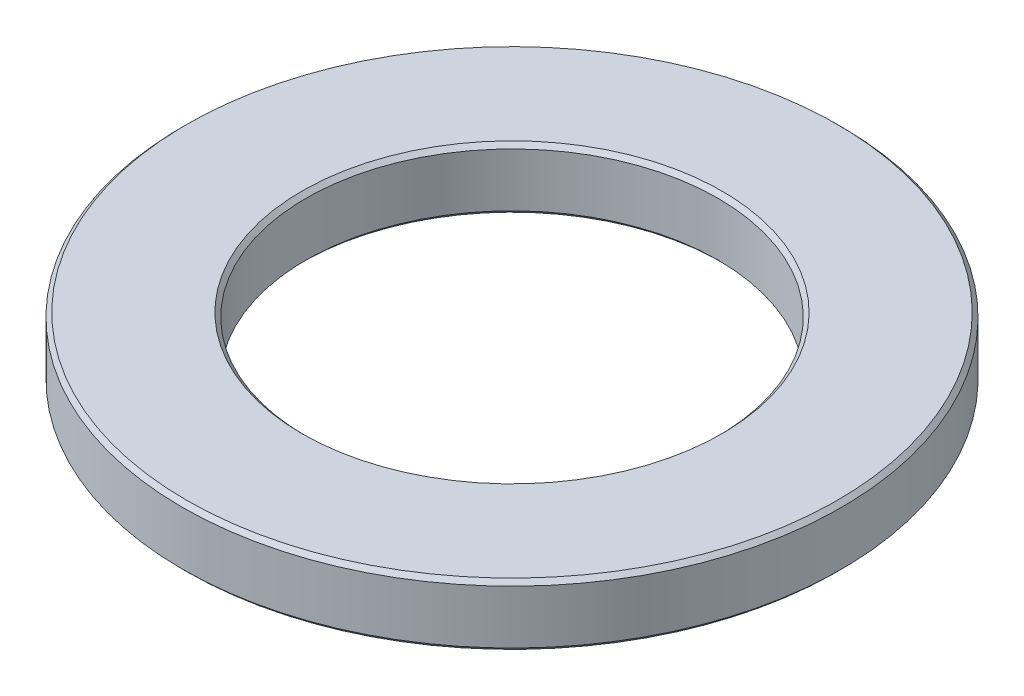
ISO-10303-21;
HEADER;
FILE_DESCRIPTION(('STEP AP214'),'2;1');
FILE_NAME('part.step','',(''),(''),'','','');
FILE_SCHEMA(('AUTOMOTIVE_DESIGN { 1 0 10303 214 1 1 1 1 }'));
ENDSEC;
DATA;
#1=APPLICATION_CONTEXT('core data for automotive mechanical design processes');
#2=APPLICATION_PROTOCOL_DEFINITION('international standard','automotive_design',2000,#1);
#3=PRODUCT_CONTEXT('',#1,'mechanical');
#4=PRODUCT('Part','Part','',(#3));
#5=PRODUCT_RELATED_PRODUCT_CATEGORY('part','',(#4));
#6=PRODUCT_DEFINITION_FORMATION('','',#4);
#7=PRODUCT_DEFINITION_CONTEXT('part definition',#1,'design');
#8=PRODUCT_DEFINITION('design','',#6,#7);
#9=PRODUCT_DEFINITION_SHAPE('','',#8);
#10=(LENGTH_UNIT() NAMED_UNIT(*) SI_UNIT(.MILLI.,.METRE.));
#11=(NAMED_UNIT(*) PLANE_ANGLE_UNIT() SI_UNIT($,.RADIAN.));
#12=(NAMED_UNIT(*) SI_UNIT($,.STERADIAN.) SOLID_ANGLE_UNIT());
#13=UNCERTAINTY_MEASURE_WITH_UNIT(LENGTH_MEASURE(1.E-05),#10,'distance_accuracy_value','');
#14=(GEOMETRIC_REPRESENTATION_CONTEXT(3) GLOBAL_UNCERTAINTY_ASSIGNED_CONTEXT((#13)) GLOBAL_UNIT_ASSIGNED_CONTEXT((#10,
#11,#12)) REPRESENTATION_CONTEXT('',''));
#15=CARTESIAN_POINT('',(0.,0.,0.));
#16=DIRECTION('',(0.,0.,1.));
#17=DIRECTION('',(1.,0.,0.));
#18=AXIS2_PLACEMENT_3D('',#15,#16,#17);
#19=CARTESIAN_POINT('',(0.,1.5,0.));
#20=DIRECTION('',(0.,1.,0.));
#21=DIRECTION('',(0.,0.,1.));
#22=AXIS2_PLACEMENT_3D('',#19,#20,#21);
#23=PLANE('',#22);
#24=CARTESIAN_POINT('',(0.,1.5,0.));
#25=DIRECTION('',(0.,1.,0.));
#26=DIRECTION('',(0.,0.,1.));
#27=AXIS2_PLACEMENT_3D('',#24,#25,#26);
#28=CIRCLE('',#27,5.1);
#29=CARTESIAN_POINT('',(0.,1.5,5.1));
#30=VERTEX_POINT('',#29);
#31=EDGE_CURVE('E10',#30,#30,#28,.F.);
#32=ORIENTED_EDGE('',*,*,#31,.T.);
#33=EDGE_LOOP('',(#32));
#34=FACE_BOUND('',#33,.T.);
#35=CARTESIAN_POINT('',(0.,1.5,0.));
#36=DIRECTION('',(0.,1.,0.));
#37=DIRECTION('',(0.,0.,1.));
#38=AXIS2_PLACEMENT_3D('',#35,#36,#37);
#39=CIRCLE('',#38,7.9);
#40=CARTESIAN_POINT('',(0.,1.5,7.9));
#41=VERTEX_POINT('',#40);
#42=EDGE_CURVE('E50',#41,#41,#39,.T.);
#43=ORIENTED_EDGE('',*,*,#42,.T.);
#44=EDGE_LOOP('',(#43));
#45=FACE_BOUND('',#44,.T.);
#46=ADVANCED_FACE('F30',(#34,#45),#23,.T.);
#47=CARTESIAN_POINT('',(0.,0.,0.));
#48=DIRECTION('',(0.,1.,0.));
#49=DIRECTION('',(0.,0.,1.));
#50=AXIS2_PLACEMENT_3D('',#47,#48,#49);
#51=PLANE('',#50);
#52=CARTESIAN_POINT('',(0.,0.,0.));
#53=DIRECTION('',(0.,1.,0.));
#54=DIRECTION('',(0.,0.,1.));
#55=AXIS2_PLACEMENT_3D('',#52,#53,#54);
#56=CIRCLE('',#55,5.1);
#57=CARTESIAN_POINT('',(0.,0.,5.1));
#58=VERTEX_POINT('',#57);
#59=EDGE_CURVE('E45',#58,#58,#56,.T.);
#60=ORIENTED_EDGE('',*,*,#59,.T.);
#61=EDGE_LOOP('',(#60));
#62=FACE_BOUND('',#61,.T.);
#63=CARTESIAN_POINT('',(0.,0.,0.));
#64=DIRECTION('',(0.,1.,0.));
#65=DIRECTION('',(0.,0.,1.));
#66=AXIS2_PLACEMENT_3D('',#63,#64,#65);
#67=CIRCLE('',#66,7.9);
#68=CARTESIAN_POINT('',(0.,0.,7.9));
#69=VERTEX_POINT('',#68);
#70=EDGE_CURVE('E53',#69,#69,#67,.F.);
#71=ORIENTED_EDGE('',*,*,#70,.T.);
#72=EDGE_LOOP('',(#71));
#73=FACE_BOUND('',#72,.T.);
#74=ADVANCED_FACE('F74',(#62,#73),#51,.F.);
#75=CARTESIAN_POINT('',(0.,1.5,0.));
#76=DIRECTION('',(0.,-1.,0.));
#77=DIRECTION('',(0.,0.,-1.));
#78=AXIS2_PLACEMENT_3D('',#75,#76,#77);
#79=CYLINDRICAL_SURFACE('',#78,8.);
#80=CARTESIAN_POINT('',(0.,0.100000000000001,0.));
#81=DIRECTION('',(0.,1.,0.));
#82=DIRECTION('',(0.,0.,1.));
#83=AXIS2_PLACEMENT_3D('',#80,#81,#82);
#84=CIRCLE('',#83,8.);
#85=CARTESIAN_POINT('',(0.,0.100000000000001,8.));
#86=VERTEX_POINT('',#85);
#87=EDGE_CURVE('E56',#86,#86,#84,.T.);
#88=ORIENTED_EDGE('',*,*,#87,.T.);
#89=EDGE_LOOP('',(#88));
#90=FACE_BOUND('',#89,.T.);
#91=CARTESIAN_POINT('',(0.,1.40000000000001,0.));
#92=DIRECTION('',(0.,1.,0.));
#93=DIRECTION('',(0.,0.,1.));
#94=AXIS2_PLACEMENT_3D('',#91,#92,#93);
#95=CIRCLE('',#94,8.);
#96=CARTESIAN_POINT('',(0.,1.40000000000001,8.));
#97=VERTEX_POINT('',#96);
#98=EDGE_CURVE('E59',#97,#97,#95,.F.);
#99=ORIENTED_EDGE('',*,*,#98,.T.);
#100=EDGE_LOOP('',(#99));
#101=FACE_BOUND('',#100,.T.);
#102=ADVANCED_FACE('F63',(#90,#101),#79,.T.);
#103=CARTESIAN_POINT('',(0.,1.5,0.));
#104=DIRECTION('',(0.,-1.,0.));
#105=DIRECTION('',(0.,0.,-1.));
#106=AXIS2_PLACEMENT_3D('',#103,#104,#105);
#107=CYLINDRICAL_SURFACE('',#106,5.);
#108=CARTESIAN_POINT('',(0.,0.1,0.));
#109=DIRECTION('',(0.,1.,0.));
#110=DIRECTION('',(0.,0.,1.));
#111=AXIS2_PLACEMENT_3D('',#108,#109,#110);
#112=CIRCLE('',#111,5.);
#113=CARTESIAN_POINT('',(0.,0.1,5.));
#114=VERTEX_POINT('',#113);
#115=EDGE_CURVE('E37',#114,#114,#112,.F.);
#116=ORIENTED_EDGE('',*,*,#115,.T.);
#117=EDGE_LOOP('',(#116));
#118=FACE_BOUND('',#117,.T.);
#119=CARTESIAN_POINT('',(0.,1.4,0.));
#120=DIRECTION('',(0.,1.,0.));
#121=DIRECTION('',(0.,0.,1.));
#122=AXIS2_PLACEMENT_3D('',#119,#120,#121);
#123=CIRCLE('',#122,5.);
#124=CARTESIAN_POINT('',(0.,1.4,5.));
#125=VERTEX_POINT('',#124);
#126=EDGE_CURVE('E41',#125,#125,#123,.T.);
#127=ORIENTED_EDGE('',*,*,#126,.T.);
#128=EDGE_LOOP('',(#127));
#129=FACE_BOUND('',#128,.T.);
#130=ADVANCED_FACE('F82',(#118,#129),#107,.F.);
#131=CARTESIAN_POINT('',(0.,0.100000000000001,0.));
#132=DIRECTION('',(0.,1.,0.));
#133=DIRECTION('',(0.,0.,1.));
#134=AXIS2_PLACEMENT_3D('',#131,#132,#133);
#135=CONICAL_SURFACE('',#134,8.,0.785398163397448);
#136=ORIENTED_EDGE('',*,*,#70,.F.);
#137=EDGE_LOOP('',(#136));
#138=FACE_BOUND('',#137,.T.);
#139=ORIENTED_EDGE('',*,*,#87,.F.);
#140=EDGE_LOOP('',(#139));
#141=FACE_BOUND('',#140,.T.);
#142=ADVANCED_FACE('F69',(#138,#141),#135,.T.);
#143=CARTESIAN_POINT('',(0.,1.5,0.));
#144=DIRECTION('',(0.,-1.,0.));
#145=DIRECTION('',(0.,0.,-1.));
#146=AXIS2_PLACEMENT_3D('',#143,#144,#145);
#147=CONICAL_SURFACE('',#146,7.9,0.785398163397466);
#148=ORIENTED_EDGE('',*,*,#98,.F.);
#149=EDGE_LOOP('',(#148));
#150=FACE_BOUND('',#149,.T.);
#151=ORIENTED_EDGE('',*,*,#42,.F.);
#152=EDGE_LOOP('',(#151));
#153=FACE_BOUND('',#152,.T.);
#154=ADVANCED_FACE('F65',(#150,#153),#147,.T.);
#155=CARTESIAN_POINT('',(0.,0.,0.));
#156=DIRECTION('',(0.,-1.,0.));
#157=DIRECTION('',(0.,0.,-1.));
#158=AXIS2_PLACEMENT_3D('',#155,#156,#157);
#159=CONICAL_SURFACE('',#158,5.1,0.785398163397448);
#160=ORIENTED_EDGE('',*,*,#115,.F.);
#161=EDGE_LOOP('',(#160));
#162=FACE_BOUND('',#161,.T.);
#163=ORIENTED_EDGE('',*,*,#59,.F.);
#164=EDGE_LOOP('',(#163));
#165=FACE_BOUND('',#164,.T.);
#166=ADVANCED_FACE('F68',(#162,#165),#159,.F.);
#167=CARTESIAN_POINT('',(0.,1.4,0.));
#168=DIRECTION('',(0.,1.,0.));
#169=DIRECTION('',(0.,0.,1.));
#170=AXIS2_PLACEMENT_3D('',#167,#168,#169);
#171=CONICAL_SURFACE('',#170,5.,0.785398163397435);
#172=ORIENTED_EDGE('',*,*,#31,.F.);
#173=EDGE_LOOP('',(#172));
#174=FACE_BOUND('',#173,.T.);
#175=ORIENTED_EDGE('',*,*,#126,.F.);
#176=EDGE_LOOP('',(#175));
#177=FACE_BOUND('',#176,.T.);
#178=ADVANCED_FACE('F32',(#174,#177),#171,.F.);
#179=CLOSED_SHELL('',(#46,#74,#102,#130,#142,#154,#166,#178));
#180=MANIFOLD_SOLID_BREP('B2',#179);
#181=ADVANCED_BREP_SHAPE_REPRESENTATION('',(#18,#180),#14);
#182=SHAPE_DEFINITION_REPRESENTATION(#9,#181);
ENDSEC;
END-ISO-10303-21;
